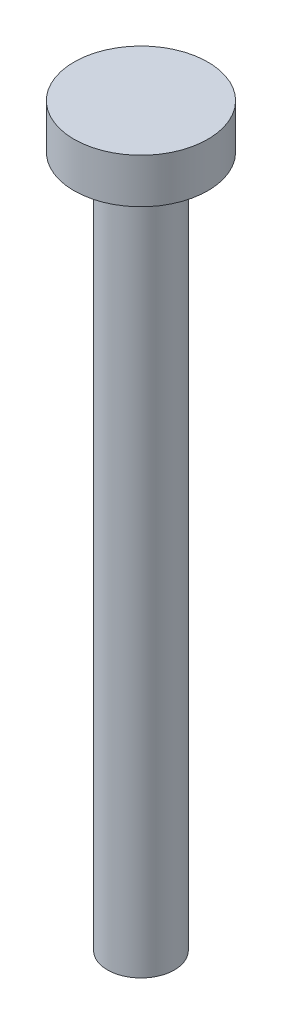
ISO-10303-21;
HEADER;
FILE_DESCRIPTION(('STEP AP214'),'2;1');
FILE_NAME('part.step','',(''),(''),'','','');
FILE_SCHEMA(('AUTOMOTIVE_DESIGN { 1 0 10303 214 1 1 1 1 }'));
ENDSEC;
DATA;
#1=APPLICATION_CONTEXT('core data for automotive mechanical design processes');
#2=APPLICATION_PROTOCOL_DEFINITION('international standard','automotive_design',2000,#1);
#3=PRODUCT_CONTEXT('',#1,'mechanical');
#4=PRODUCT('Part','Part','',(#3));
#5=PRODUCT_RELATED_PRODUCT_CATEGORY('part','',(#4));
#6=PRODUCT_DEFINITION_FORMATION('','',#4);
#7=PRODUCT_DEFINITION_CONTEXT('part definition',#1,'design');
#8=PRODUCT_DEFINITION('design','',#6,#7);
#9=PRODUCT_DEFINITION_SHAPE('','',#8);
#10=(LENGTH_UNIT() NAMED_UNIT(*) SI_UNIT(.MILLI.,.METRE.));
#11=(NAMED_UNIT(*) PLANE_ANGLE_UNIT() SI_UNIT($,.RADIAN.));
#12=(NAMED_UNIT(*) SI_UNIT($,.STERADIAN.) SOLID_ANGLE_UNIT());
#13=UNCERTAINTY_MEASURE_WITH_UNIT(LENGTH_MEASURE(1.E-05),#10,'distance_accuracy_value','');
#14=(GEOMETRIC_REPRESENTATION_CONTEXT(3) GLOBAL_UNCERTAINTY_ASSIGNED_CONTEXT((#13)) GLOBAL_UNIT_ASSIGNED_CONTEXT((#10,
#11,#12)) REPRESENTATION_CONTEXT('',''));
#15=CARTESIAN_POINT('',(0.,0.,0.));
#16=DIRECTION('',(0.,0.,1.));
#17=DIRECTION('',(1.,0.,0.));
#18=AXIS2_PLACEMENT_3D('',#15,#16,#17);
#19=CARTESIAN_POINT('',(0.,31.,0.));
#20=DIRECTION('',(0.,-1.,0.));
#21=DIRECTION('',(0.,0.,-1.));
#22=AXIS2_PLACEMENT_3D('',#19,#20,#21);
#23=CYLINDRICAL_SURFACE('',#22,1.5);
#24=CARTESIAN_POINT('',(0.,30.,0.));
#25=DIRECTION('',(0.,1.,0.));
#26=DIRECTION('',(0.,0.,1.));
#27=AXIS2_PLACEMENT_3D('',#24,#25,#26);
#28=CIRCLE('',#27,1.5);
#29=CARTESIAN_POINT('',(0.,30.,1.5));
#30=VERTEX_POINT('',#29);
#31=EDGE_CURVE('E10',#30,#30,#28,.F.);
#32=ORIENTED_EDGE('',*,*,#31,.T.);
#33=EDGE_LOOP('',(#32));
#34=FACE_BOUND('',#33,.T.);
#35=CARTESIAN_POINT('',(0.,0.,0.));
#36=DIRECTION('',(0.,1.,0.));
#37=DIRECTION('',(0.,0.,1.));
#38=AXIS2_PLACEMENT_3D('',#35,#36,#37);
#39=CIRCLE('',#38,1.5);
#40=CARTESIAN_POINT('',(0.,0.,1.5));
#41=VERTEX_POINT('',#40);
#42=EDGE_CURVE('E45',#41,#41,#39,.T.);
#43=ORIENTED_EDGE('',*,*,#42,.T.);
#44=EDGE_LOOP('',(#43));
#45=FACE_BOUND('',#44,.T.);
#46=ADVANCED_FACE('F34',(#34,#45),#23,.T.);
#47=CARTESIAN_POINT('',(0.,0.,0.));
#48=DIRECTION('',(0.,1.,0.));
#49=DIRECTION('',(0.,0.,1.));
#50=AXIS2_PLACEMENT_3D('',#47,#48,#49);
#51=PLANE('',#50);
#52=ORIENTED_EDGE('',*,*,#42,.F.);
#53=EDGE_LOOP('',(#52));
#54=FACE_BOUND('',#53,.T.);
#55=ADVANCED_FACE('F63',(#54),#51,.F.);
#56=CARTESIAN_POINT('',(0.,33.,0.));
#57=DIRECTION('',(0.,-1.,0.));
#58=DIRECTION('',(0.,0.,-1.));
#59=AXIS2_PLACEMENT_3D('',#56,#57,#58);
#60=CYLINDRICAL_SURFACE('',#59,3.);
#61=CARTESIAN_POINT('',(0.,33.,0.));
#62=DIRECTION('',(0.,1.,0.));
#63=DIRECTION('',(0.,0.,1.));
#64=AXIS2_PLACEMENT_3D('',#61,#62,#63);
#65=CIRCLE('',#64,3.);
#66=CARTESIAN_POINT('',(0.,33.,3.));
#67=VERTEX_POINT('',#66);
#68=EDGE_CURVE('E49',#67,#67,#65,.T.);
#69=ORIENTED_EDGE('',*,*,#68,.F.);
#70=EDGE_LOOP('',(#69));
#71=FACE_BOUND('',#70,.T.);
#72=CARTESIAN_POINT('',(0.,31.,0.));
#73=DIRECTION('',(0.,1.,0.));
#74=DIRECTION('',(0.,0.,1.));
#75=AXIS2_PLACEMENT_3D('',#72,#73,#74);
#76=CIRCLE('',#75,3.);
#77=CARTESIAN_POINT('',(0.,31.,3.));
#78=VERTEX_POINT('',#77);
#79=EDGE_CURVE('E52',#78,#78,#76,.T.);
#80=ORIENTED_EDGE('',*,*,#79,.T.);
#81=EDGE_LOOP('',(#80));
#82=FACE_BOUND('',#81,.T.);
#83=ADVANCED_FACE('F60',(#71,#82),#60,.T.);
#84=CARTESIAN_POINT('',(0.,33.,0.));
#85=DIRECTION('',(0.,1.,0.));
#86=DIRECTION('',(0.,0.,1.));
#87=AXIS2_PLACEMENT_3D('',#84,#85,#86);
#88=PLANE('',#87);
#89=ORIENTED_EDGE('',*,*,#68,.T.);
#90=EDGE_LOOP('',(#89));
#91=FACE_BOUND('',#90,.T.);
#92=ADVANCED_FACE('F58',(#91),#88,.T.);
#93=CARTESIAN_POINT('',(0.,31.,0.));
#94=DIRECTION('',(0.,1.,0.));
#95=DIRECTION('',(0.,0.,1.));
#96=AXIS2_PLACEMENT_3D('',#93,#94,#95);
#97=PLANE('',#96);
#98=CARTESIAN_POINT('',(0.,31.,0.));
#99=DIRECTION('',(0.,1.,0.));
#100=DIRECTION('',(0.,0.,1.));
#101=AXIS2_PLACEMENT_3D('',#98,#99,#100);
#102=CIRCLE('',#101,2.5);
#103=CARTESIAN_POINT('',(0.,31.,2.5));
#104=VERTEX_POINT('',#103);
#105=EDGE_CURVE('E41',#104,#104,#102,.T.);
#106=ORIENTED_EDGE('',*,*,#105,.T.);
#107=EDGE_LOOP('',(#106));
#108=FACE_BOUND('',#107,.T.);
#109=ORIENTED_EDGE('',*,*,#79,.F.);
#110=EDGE_LOOP('',(#109));
#111=FACE_BOUND('',#110,.T.);
#112=ADVANCED_FACE('F67',(#108,#111),#97,.F.);
#113=CARTESIAN_POINT('',(0.,30.,0.));
#114=DIRECTION('',(0.,1.,0.));
#115=DIRECTION('',(0.,0.,1.));
#116=AXIS2_PLACEMENT_3D('',#113,#114,#115);
#117=TOROIDAL_SURFACE('',#116,2.5,1.);
#118=ORIENTED_EDGE('',*,*,#31,.F.);
#119=EDGE_LOOP('',(#118));
#120=FACE_BOUND('',#119,.T.);
#121=ORIENTED_EDGE('',*,*,#105,.F.);
#122=EDGE_LOOP('',(#121));
#123=FACE_BOUND('',#122,.T.);
#124=ADVANCED_FACE('F36',(#120,#123),#117,.F.);
#125=CLOSED_SHELL('',(#46,#55,#83,#92,#112,#124));
#126=MANIFOLD_SOLID_BREP('B2',#125);
#127=ADVANCED_BREP_SHAPE_REPRESENTATION('',(#18,#126),#14);
#128=SHAPE_DEFINITION_REPRESENTATION(#9,#127);
ENDSEC;
END-ISO-10303-21;
